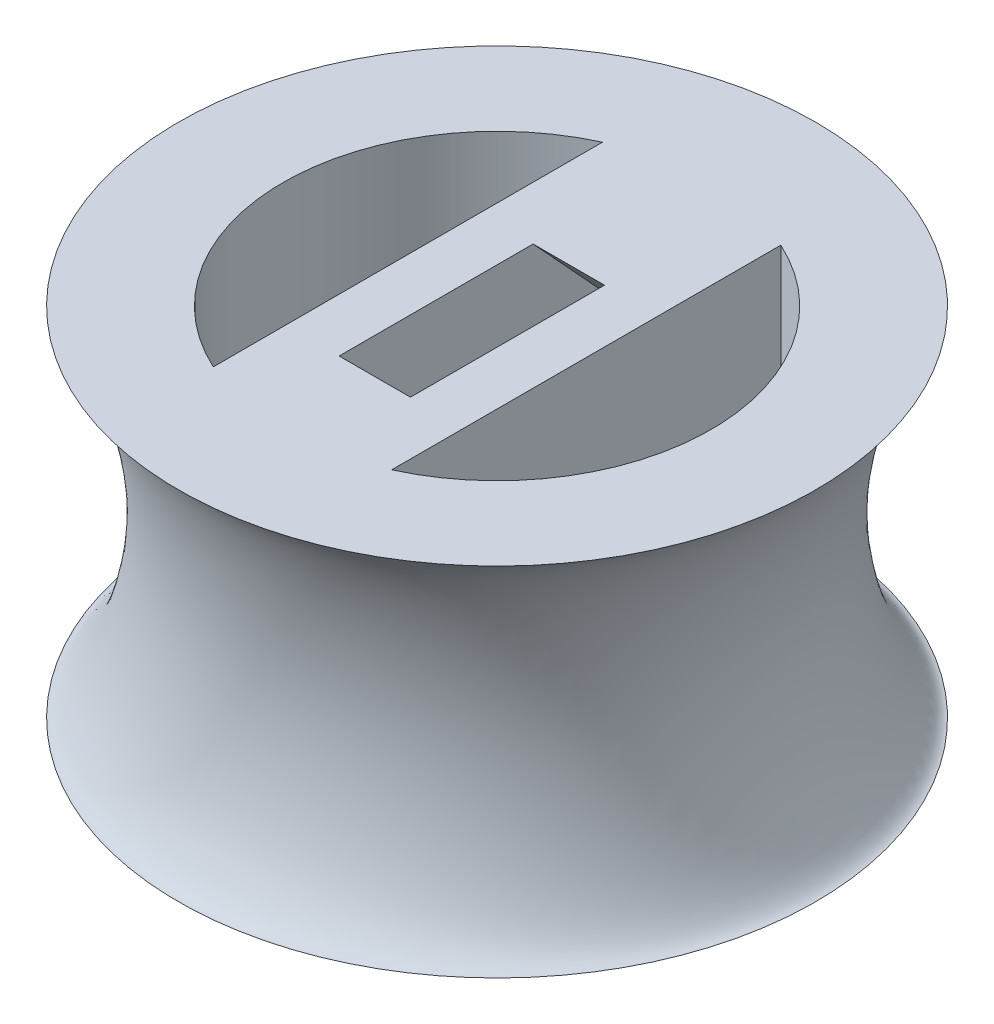
ISO-10303-21;
HEADER;
FILE_DESCRIPTION(('STEP AP214'),'2;1');
FILE_NAME('part.step','',(''),(''),'','','');
FILE_SCHEMA(('AUTOMOTIVE_DESIGN { 1 0 10303 214 1 1 1 1 }'));
ENDSEC;
DATA;
#1=APPLICATION_CONTEXT('core data for automotive mechanical design processes');
#2=APPLICATION_PROTOCOL_DEFINITION('international standard','automotive_design',2000,#1);
#3=PRODUCT_CONTEXT('',#1,'mechanical');
#4=PRODUCT('Part','Part','',(#3));
#5=PRODUCT_RELATED_PRODUCT_CATEGORY('part','',(#4));
#6=PRODUCT_DEFINITION_FORMATION('','',#4);
#7=PRODUCT_DEFINITION_CONTEXT('part definition',#1,'design');
#8=PRODUCT_DEFINITION('design','',#6,#7);
#9=PRODUCT_DEFINITION_SHAPE('','',#8);
#10=(LENGTH_UNIT() NAMED_UNIT(*) SI_UNIT(.MILLI.,.METRE.));
#11=(NAMED_UNIT(*) PLANE_ANGLE_UNIT() SI_UNIT($,.RADIAN.));
#12=(NAMED_UNIT(*) SI_UNIT($,.STERADIAN.) SOLID_ANGLE_UNIT());
#13=UNCERTAINTY_MEASURE_WITH_UNIT(LENGTH_MEASURE(1.E-05),#10,'distance_accuracy_value','');
#14=(GEOMETRIC_REPRESENTATION_CONTEXT(3) GLOBAL_UNCERTAINTY_ASSIGNED_CONTEXT((#13)) GLOBAL_UNIT_ASSIGNED_CONTEXT((#10,
#11,#12)) REPRESENTATION_CONTEXT('',''));
#15=CARTESIAN_POINT('',(0.,0.,0.));
#16=DIRECTION('',(0.,0.,1.));
#17=DIRECTION('',(1.,0.,0.));
#18=AXIS2_PLACEMENT_3D('',#15,#16,#17);
#19=CARTESIAN_POINT('',(0.,10.,0.));
#20=DIRECTION('',(0.,1.,0.));
#21=DIRECTION('',(0.,0.,1.));
#22=AXIS2_PLACEMENT_3D('',#19,#20,#21);
#23=PLANE('',#22);
#24=DIRECTION('',(0.,0.,-1.));
#25=VECTOR('',#24,1.);
#26=CARTESIAN_POINT('',(-2.5,10.,0.));
#27=LINE('',#26,#25);
#28=CARTESIAN_POINT('',(-2.5,10.,5.45435605731786));
#29=VERTEX_POINT('',#28);
#30=CARTESIAN_POINT('',(-2.5,10.,-5.45435605731786));
#31=VERTEX_POINT('',#30);
#32=EDGE_CURVE('E146',#29,#31,#27,.T.);
#33=ORIENTED_EDGE('',*,*,#32,.F.);
#34=CARTESIAN_POINT('',(0.,10.,0.));
#35=DIRECTION('',(0.,1.,0.));
#36=DIRECTION('',(0.,0.,1.));
#37=AXIS2_PLACEMENT_3D('',#34,#35,#36);
#38=CIRCLE('',#37,6.);
#39=EDGE_CURVE('E142',#31,#29,#38,.T.);
#40=ORIENTED_EDGE('',*,*,#39,.F.);
#41=EDGE_LOOP('',(#33,#40));
#42=FACE_BOUND('',#41,.T.);
#43=CARTESIAN_POINT('',(0.,10.,0.));
#44=DIRECTION('',(0.,-1.,0.));
#45=DIRECTION('',(0.,0.,-1.));
#46=AXIS2_PLACEMENT_3D('',#43,#44,#45);
#47=CIRCLE('',#46,8.92992468574349);
#48=CARTESIAN_POINT('',(0.,10.,-8.92992468574349));
#49=VERTEX_POINT('',#48);
#50=EDGE_CURVE('E11',#49,#49,#47,.T.);
#51=ORIENTED_EDGE('',*,*,#50,.F.);
#52=EDGE_LOOP('',(#51));
#53=FACE_BOUND('',#52,.T.);
#54=CARTESIAN_POINT('',(0.,10.,0.));
#55=DIRECTION('',(0.,1.,0.));
#56=DIRECTION('',(0.,0.,1.));
#57=AXIS2_PLACEMENT_3D('',#54,#55,#56);
#58=CIRCLE('',#57,6.);
#59=CARTESIAN_POINT('',(2.5,10.,5.45435605731786));
#60=VERTEX_POINT('',#59);
#61=CARTESIAN_POINT('',(2.5,10.,-5.45435605731786));
#62=VERTEX_POINT('',#61);
#63=EDGE_CURVE('E134',#60,#62,#58,.T.);
#64=ORIENTED_EDGE('',*,*,#63,.F.);
#65=DIRECTION('',(0.,0.,-1.));
#66=VECTOR('',#65,1.);
#67=CARTESIAN_POINT('',(2.5,10.,0.));
#68=LINE('',#67,#66);
#69=EDGE_CURVE('E131',#60,#62,#68,.T.);
#70=ORIENTED_EDGE('',*,*,#69,.T.);
#71=EDGE_LOOP('',(#64,#70));
#72=FACE_BOUND('',#71,.T.);
#73=DIRECTION('',(1.,0.,0.));
#74=VECTOR('',#73,1.);
#75=CARTESIAN_POINT('',(-1.,10.,3.42764163278939));
#76=LINE('',#75,#74);
#77=CARTESIAN_POINT('',(-1.,10.,3.42764163278939));
#78=VERTEX_POINT('',#77);
#79=CARTESIAN_POINT('',(1.,10.,3.42764163278939));
#80=VERTEX_POINT('',#79);
#81=EDGE_CURVE('E319',#78,#80,#76,.T.);
#82=ORIENTED_EDGE('',*,*,#81,.F.);
#83=DIRECTION('',(0.,0.,-1.));
#84=VECTOR('',#83,1.);
#85=CARTESIAN_POINT('',(-1.,10.,3.42764163278939));
#86=LINE('',#85,#84);
#87=CARTESIAN_POINT('',(-1.,10.,-2.01113744006485));
#88=VERTEX_POINT('',#87);
#89=EDGE_CURVE('E130',#78,#88,#86,.T.);
#90=ORIENTED_EDGE('',*,*,#89,.T.);
#91=DIRECTION('',(1.,0.,0.));
#92=VECTOR('',#91,1.);
#93=CARTESIAN_POINT('',(-1.,10.,-2.01113744006485));
#94=LINE('',#93,#92);
#95=CARTESIAN_POINT('',(1.,10.,-2.01113744006485));
#96=VERTEX_POINT('',#95);
#97=EDGE_CURVE('E115',#88,#96,#94,.T.);
#98=ORIENTED_EDGE('',*,*,#97,.T.);
#99=DIRECTION('',(0.,0.,-1.));
#100=VECTOR('',#99,1.);
#101=CARTESIAN_POINT('',(1.,10.,3.42764163278939));
#102=LINE('',#101,#100);
#103=EDGE_CURVE('E122',#80,#96,#102,.T.);
#104=ORIENTED_EDGE('',*,*,#103,.F.);
#105=EDGE_LOOP('',(#82,#90,#98,#104));
#106=FACE_BOUND('',#105,.T.);
#107=ADVANCED_FACE('F33',(#42,#53,#72,#106),#23,.T.);
#108=CARTESIAN_POINT('',(0.,0.,0.));
#109=DIRECTION('',(0.,1.,0.));
#110=DIRECTION('',(0.,0.,1.));
#111=AXIS2_PLACEMENT_3D('',#108,#109,#110);
#112=PLANE('',#111);
#113=CARTESIAN_POINT('',(0.,0.,0.));
#114=DIRECTION('',(0.,1.,0.));
#115=DIRECTION('',(0.,0.,1.));
#116=AXIS2_PLACEMENT_3D('',#113,#114,#115);
#117=CIRCLE('',#116,6.);
#118=CARTESIAN_POINT('',(-2.5,0.,-5.45435605731786));
#119=VERTEX_POINT('',#118);
#120=CARTESIAN_POINT('',(-2.5,0.,5.45435605731786));
#121=VERTEX_POINT('',#120);
#122=EDGE_CURVE('E141',#119,#121,#117,.T.);
#123=ORIENTED_EDGE('',*,*,#122,.T.);
#124=DIRECTION('',(0.,0.,-1.));
#125=VECTOR('',#124,1.);
#126=CARTESIAN_POINT('',(-2.5,0.,0.));
#127=LINE('',#126,#125);
#128=EDGE_CURVE('E56',#121,#119,#127,.T.);
#129=ORIENTED_EDGE('',*,*,#128,.T.);
#130=EDGE_LOOP('',(#123,#129));
#131=FACE_BOUND('',#130,.T.);
#132=CARTESIAN_POINT('',(0.,0.,0.));
#133=DIRECTION('',(0.,-1.,0.));
#134=DIRECTION('',(0.,0.,-1.));
#135=AXIS2_PLACEMENT_3D('',#132,#133,#134);
#136=CIRCLE('',#135,8.92992468574348);
#137=CARTESIAN_POINT('',(0.,0.,-8.92992468574348));
#138=VERTEX_POINT('',#137);
#139=EDGE_CURVE('E37',#138,#138,#136,.T.);
#140=ORIENTED_EDGE('',*,*,#139,.T.);
#141=EDGE_LOOP('',(#140));
#142=FACE_BOUND('',#141,.T.);
#143=DIRECTION('',(0.,0.,-1.));
#144=VECTOR('',#143,1.);
#145=CARTESIAN_POINT('',(2.5,0.,0.));
#146=LINE('',#145,#144);
#147=CARTESIAN_POINT('',(2.5,0.,5.45435605731786));
#148=VERTEX_POINT('',#147);
#149=CARTESIAN_POINT('',(2.5,0.,-5.45435605731786));
#150=VERTEX_POINT('',#149);
#151=EDGE_CURVE('E155',#148,#150,#146,.T.);
#152=ORIENTED_EDGE('',*,*,#151,.F.);
#153=CARTESIAN_POINT('',(0.,0.,0.));
#154=DIRECTION('',(0.,1.,0.));
#155=DIRECTION('',(0.,0.,1.));
#156=AXIS2_PLACEMENT_3D('',#153,#154,#155);
#157=CIRCLE('',#156,6.);
#158=EDGE_CURVE('E158',#148,#150,#157,.T.);
#159=ORIENTED_EDGE('',*,*,#158,.T.);
#160=EDGE_LOOP('',(#152,#159));
#161=FACE_BOUND('',#160,.T.);
#162=ADVANCED_FACE('F35',(#131,#142,#161),#112,.F.);
#163=CARTESIAN_POINT('',(-9.,10.,0.));
#164=CARTESIAN_POINT('',(-8.33917700840599,10.0905059359981,0.));
#165=CARTESIAN_POINT('',(-6.32082299159401,5.,0.));
#166=CARTESIAN_POINT('',(-10.2535725300821,-4.91881736489846,0.));
#167=CARTESIAN_POINT('',(-10.2535725300821,9.82831142890039,0.));
#168=CARTESIAN_POINT('',(-9.,10.,0.));
#169=B_SPLINE_CURVE_WITH_KNOTS('',3,(#163,#164,#165,#166,#167,#168),.UNSPECIFIED.,.T.,.F.,(4,1,
1,4),(0.,0.256608512321881,0.513217024643762,1.),.UNSPECIFIED.);
#170=CARTESIAN_POINT('',(0.,0.,0.));
#171=DIRECTION('',(0.,-1.,0.));
#172=AXIS1_PLACEMENT('',#170,#171);
#173=SURFACE_OF_REVOLUTION('',#169,#172);
#174=ORIENTED_EDGE('',*,*,#50,.T.);
#175=EDGE_LOOP('',(#174));
#176=FACE_BOUND('',#175,.T.);
#177=ORIENTED_EDGE('',*,*,#139,.F.);
#178=EDGE_LOOP('',(#177));
#179=FACE_BOUND('',#178,.T.);
#180=ADVANCED_FACE('F174',(#176,#179),#173,.T.);
#181=CARTESIAN_POINT('',(2.5,0.,0.));
#182=DIRECTION('',(1.,0.,0.));
#183=DIRECTION('',(0.,0.,-1.));
#184=AXIS2_PLACEMENT_3D('',#181,#182,#183);
#185=PLANE('',#184);
#186=ORIENTED_EDGE('',*,*,#69,.F.);
#187=DIRECTION('',(0.,1.,0.));
#188=VECTOR('',#187,1.);
#189=CARTESIAN_POINT('',(2.5,0.,5.45435605731786));
#190=LINE('',#189,#188);
#191=EDGE_CURVE('E160',#148,#60,#190,.T.);
#192=ORIENTED_EDGE('',*,*,#191,.F.);
#193=ORIENTED_EDGE('',*,*,#151,.T.);
#194=DIRECTION('',(0.,1.,0.));
#195=VECTOR('',#194,1.);
#196=CARTESIAN_POINT('',(2.5,0.,-5.45435605731786));
#197=LINE('',#196,#195);
#198=EDGE_CURVE('E148',#150,#62,#197,.T.);
#199=ORIENTED_EDGE('',*,*,#198,.T.);
#200=EDGE_LOOP('',(#186,#192,#193,#199));
#201=FACE_BOUND('',#200,.T.);
#202=ADVANCED_FACE('F177',(#201),#185,.T.);
#203=CARTESIAN_POINT('',(0.,0.,0.));
#204=DIRECTION('',(0.,1.,0.));
#205=DIRECTION('',(0.,0.,1.));
#206=AXIS2_PLACEMENT_3D('',#203,#204,#205);
#207=CYLINDRICAL_SURFACE('',#206,6.);
#208=ORIENTED_EDGE('',*,*,#63,.T.);
#209=ORIENTED_EDGE('',*,*,#198,.F.);
#210=ORIENTED_EDGE('',*,*,#158,.F.);
#211=ORIENTED_EDGE('',*,*,#191,.T.);
#212=EDGE_LOOP('',(#208,#209,#210,#211));
#213=FACE_BOUND('',#212,.T.);
#214=ADVANCED_FACE('F193',(#213),#207,.F.);
#215=CARTESIAN_POINT('',(-2.5,0.,0.));
#216=DIRECTION('',(1.,0.,0.));
#217=DIRECTION('',(0.,0.,-1.));
#218=AXIS2_PLACEMENT_3D('',#215,#216,#217);
#219=PLANE('',#218);
#220=ORIENTED_EDGE('',*,*,#32,.T.);
#221=DIRECTION('',(0.,1.,0.));
#222=VECTOR('',#221,1.);
#223=CARTESIAN_POINT('',(-2.5,0.,-5.45435605731786));
#224=LINE('',#223,#222);
#225=EDGE_CURVE('E145',#119,#31,#224,.T.);
#226=ORIENTED_EDGE('',*,*,#225,.F.);
#227=ORIENTED_EDGE('',*,*,#128,.F.);
#228=DIRECTION('',(0.,1.,0.));
#229=VECTOR('',#228,1.);
#230=CARTESIAN_POINT('',(-2.5,0.,5.45435605731786));
#231=LINE('',#230,#229);
#232=EDGE_CURVE('E151',#121,#29,#231,.T.);
#233=ORIENTED_EDGE('',*,*,#232,.T.);
#234=EDGE_LOOP('',(#220,#226,#227,#233));
#235=FACE_BOUND('',#234,.T.);
#236=ADVANCED_FACE('F202',(#235),#219,.F.);
#237=CARTESIAN_POINT('',(0.,0.,0.));
#238=DIRECTION('',(0.,1.,0.));
#239=DIRECTION('',(0.,0.,1.));
#240=AXIS2_PLACEMENT_3D('',#237,#238,#239);
#241=CYLINDRICAL_SURFACE('',#240,6.);
#242=ORIENTED_EDGE('',*,*,#39,.T.);
#243=ORIENTED_EDGE('',*,*,#232,.F.);
#244=ORIENTED_EDGE('',*,*,#122,.F.);
#245=ORIENTED_EDGE('',*,*,#225,.T.);
#246=EDGE_LOOP('',(#242,#243,#244,#245));
#247=FACE_BOUND('',#246,.T.);
#248=ADVANCED_FACE('F206',(#247),#241,.F.);
#249=CARTESIAN_POINT('',(-1.,10.,-2.01113744006485));
#250=DIRECTION('',(0.,-0.677569032479732,0.735459180529062));
#251=DIRECTION('',(0.,-0.735459180529062,-0.677569032479732));
#252=AXIS2_PLACEMENT_3D('',#249,#250,#251);
#253=PLANE('',#252);
#254=ORIENTED_EDGE('',*,*,#97,.F.);
#255=DIRECTION('',(0.,-0.735459180529062,-0.677569032479732));
#256=VECTOR('',#255,1.);
#257=CARTESIAN_POINT('',(-1.,10.,-2.01113744006485));
#258=LINE('',#257,#256);
#259=CARTESIAN_POINT('',(-1.,7.27660461908465,-4.52016638709513));
#260=VERTEX_POINT('',#259);
#261=EDGE_CURVE('E317',#88,#260,#258,.T.);
#262=ORIENTED_EDGE('',*,*,#261,.T.);
#263=DIRECTION('',(1.,0.,0.));
#264=VECTOR('',#263,1.);
#265=CARTESIAN_POINT('',(-1.,7.27660461908465,-4.52016638709513));
#266=LINE('',#265,#264);
#267=CARTESIAN_POINT('',(1.,7.27660461908465,-4.52016638709513));
#268=VERTEX_POINT('',#267);
#269=EDGE_CURVE('E118',#260,#268,#266,.T.);
#270=ORIENTED_EDGE('',*,*,#269,.T.);
#271=DIRECTION('',(0.,-0.735459180529062,-0.677569032479732));
#272=VECTOR('',#271,1.);
#273=CARTESIAN_POINT('',(1.,10.,-2.01113744006485));
#274=LINE('',#273,#272);
#275=EDGE_CURVE('E112',#96,#268,#274,.T.);
#276=ORIENTED_EDGE('',*,*,#275,.F.);
#277=EDGE_LOOP('',(#254,#262,#270,#276));
#278=FACE_BOUND('',#277,.T.);
#279=ADVANCED_FACE('F113',(#278),#253,.T.);
#280=CARTESIAN_POINT('',(-1.,6.59903558660492,-3.78470720656607));
#281=DIRECTION('',(1.,0.,0.));
#282=DIRECTION('',(0.,0.,-1.));
#283=AXIS2_PLACEMENT_3D('',#280,#281,#282);
#284=CYLINDRICAL_SURFACE('',#283,1.);
#285=ORIENTED_EDGE('',*,*,#269,.F.);
#286=CARTESIAN_POINT('',(-1.,6.59903558660492,-3.78470720656607));
#287=DIRECTION('',(-1.,0.,0.));
#288=DIRECTION('',(0.,0.,-1.));
#289=AXIS2_PLACEMENT_3D('',#286,#287,#288);
#290=CIRCLE('',#289,1.);
#291=CARTESIAN_POINT('',(-1.,5.86357640607585,-4.4622762390458));
#292=VERTEX_POINT('',#291);
#293=EDGE_CURVE('E330',#260,#292,#290,.T.);
#294=ORIENTED_EDGE('',*,*,#293,.T.);
#295=DIRECTION('',(1.,0.,0.));
#296=VECTOR('',#295,1.);
#297=CARTESIAN_POINT('',(-1.,5.86357640607585,-4.4622762390458));
#298=LINE('',#297,#296);
#299=CARTESIAN_POINT('',(1.,5.86357640607585,-4.4622762390458));
#300=VERTEX_POINT('',#299);
#301=EDGE_CURVE('E136',#292,#300,#298,.T.);
#302=ORIENTED_EDGE('',*,*,#301,.T.);
#303=CARTESIAN_POINT('',(1.,6.59903558660492,-3.78470720656607));
#304=DIRECTION('',(-1.,0.,0.));
#305=DIRECTION('',(0.,0.,-1.));
#306=AXIS2_PLACEMENT_3D('',#303,#304,#305);
#307=CIRCLE('',#306,1.);
#308=EDGE_CURVE('E121',#268,#300,#307,.T.);
#309=ORIENTED_EDGE('',*,*,#308,.F.);
#310=EDGE_LOOP('',(#285,#294,#302,#309));
#311=FACE_BOUND('',#310,.T.);
#312=ADVANCED_FACE('F214',(#311),#284,.F.);
#313=CARTESIAN_POINT('',(-1.,5.86357640607585,-4.4622762390458));
#314=DIRECTION('',(0.,0.735459180529063,0.677569032479732));
#315=DIRECTION('',(0.,-0.677569032479732,0.735459180529062));
#316=AXIS2_PLACEMENT_3D('',#313,#314,#315);
#317=PLANE('',#316);
#318=ORIENTED_EDGE('',*,*,#301,.F.);
#319=DIRECTION('',(0.,-0.677569032479732,0.735459180529063));
#320=VECTOR('',#319,1.);
#321=CARTESIAN_POINT('',(-1.,5.86357640607585,-4.4622762390458));
#322=LINE('',#321,#320);
#323=CARTESIAN_POINT('',(-1.,4.50843834111639,-2.99135787798768));
#324=VERTEX_POINT('',#323);
#325=EDGE_CURVE('E344',#292,#324,#322,.T.);
#326=ORIENTED_EDGE('',*,*,#325,.T.);
#327=DIRECTION('',(1.,0.,0.));
#328=VECTOR('',#327,1.);
#329=CARTESIAN_POINT('',(-1.,4.50843834111639,-2.99135787798768));
#330=LINE('',#329,#328);
#331=CARTESIAN_POINT('',(1.,4.50843834111639,-2.99135787798768));
#332=VERTEX_POINT('',#331);
#333=EDGE_CURVE('E322',#324,#332,#330,.T.);
#334=ORIENTED_EDGE('',*,*,#333,.T.);
#335=DIRECTION('',(0.,-0.677569032479732,0.735459180529063));
#336=VECTOR('',#335,1.);
#337=CARTESIAN_POINT('',(1.,5.86357640607585,-4.4622762390458));
#338=LINE('',#337,#336);
#339=EDGE_CURVE('E333',#300,#332,#338,.T.);
#340=ORIENTED_EDGE('',*,*,#339,.F.);
#341=EDGE_LOOP('',(#318,#326,#334,#340));
#342=FACE_BOUND('',#341,.T.);
#343=ADVANCED_FACE('F217',(#342),#317,.T.);
#344=CARTESIAN_POINT('',(-1.,5.24389752164545,-2.31378884550795));
#345=DIRECTION('',(1.,0.,0.));
#346=DIRECTION('',(0.,0.,-1.));
#347=AXIS2_PLACEMENT_3D('',#344,#345,#346);
#348=CYLINDRICAL_SURFACE('',#347,1.);
#349=ORIENTED_EDGE('',*,*,#333,.F.);
#350=CARTESIAN_POINT('',(-1.,5.24389752164545,-2.31378884550795));
#351=DIRECTION('',(-1.,0.,0.));
#352=DIRECTION('',(0.,0.,1.));
#353=AXIS2_PLACEMENT_3D('',#350,#351,#352);
#354=CIRCLE('',#353,1.);
#355=CARTESIAN_POINT('',(-1.,4.56632848916572,-1.57832966497888));
#356=VERTEX_POINT('',#355);
#357=EDGE_CURVE('E324',#324,#356,#354,.T.);
#358=ORIENTED_EDGE('',*,*,#357,.T.);
#359=DIRECTION('',(1.,0.,0.));
#360=VECTOR('',#359,1.);
#361=CARTESIAN_POINT('',(-1.,4.56632848916572,-1.57832966497888));
#362=LINE('',#361,#360);
#363=CARTESIAN_POINT('',(1.,4.56632848916572,-1.57832966497888));
#364=VERTEX_POINT('',#363);
#365=EDGE_CURVE('E320',#356,#364,#362,.T.);
#366=ORIENTED_EDGE('',*,*,#365,.T.);
#367=CARTESIAN_POINT('',(1.,5.24389752164545,-2.31378884550795));
#368=DIRECTION('',(-1.,0.,0.));
#369=DIRECTION('',(0.,0.,1.));
#370=AXIS2_PLACEMENT_3D('',#367,#368,#369);
#371=CIRCLE('',#370,1.);
#372=EDGE_CURVE('E336',#332,#364,#371,.T.);
#373=ORIENTED_EDGE('',*,*,#372,.F.);
#374=EDGE_LOOP('',(#349,#358,#366,#373));
#375=FACE_BOUND('',#374,.T.);
#376=ADVANCED_FACE('F221',(#375),#348,.F.);
#377=CARTESIAN_POINT('',(-1.,4.56632848916572,-1.57832966497888));
#378=DIRECTION('',(0.,0.677569032479732,-0.735459180529063));
#379=DIRECTION('',(0.,0.735459180529063,0.677569032479732));
#380=AXIS2_PLACEMENT_3D('',#377,#378,#379);
#381=PLANE('',#380);
#382=ORIENTED_EDGE('',*,*,#365,.F.);
#383=DIRECTION('',(0.,0.735459180529063,0.677569032479732));
#384=VECTOR('',#383,1.);
#385=CARTESIAN_POINT('',(-1.,4.56632848916572,-1.57832966497888));
#386=LINE('',#385,#384);
#387=EDGE_CURVE('E315',#356,#78,#386,.T.);
#388=ORIENTED_EDGE('',*,*,#387,.T.);
#389=ORIENTED_EDGE('',*,*,#81,.T.);
#390=DIRECTION('',(0.,0.735459180529063,0.677569032479732));
#391=VECTOR('',#390,1.);
#392=CARTESIAN_POINT('',(1.,4.56632848916572,-1.57832966497888));
#393=LINE('',#392,#391);
#394=EDGE_CURVE('E48',#364,#80,#393,.T.);
#395=ORIENTED_EDGE('',*,*,#394,.F.);
#396=EDGE_LOOP('',(#382,#388,#389,#395));
#397=FACE_BOUND('',#396,.T.);
#398=ADVANCED_FACE('F225',(#397),#381,.T.);
#399=CARTESIAN_POINT('',(-1.,6.59903558660492,-3.78470720656607));
#400=DIRECTION('',(1.,0.,0.));
#401=DIRECTION('',(0.,0.,-1.));
#402=AXIS2_PLACEMENT_3D('',#399,#400,#401);
#403=PLANE('',#402);
#404=ORIENTED_EDGE('',*,*,#89,.F.);
#405=ORIENTED_EDGE('',*,*,#387,.F.);
#406=ORIENTED_EDGE('',*,*,#357,.F.);
#407=ORIENTED_EDGE('',*,*,#325,.F.);
#408=ORIENTED_EDGE('',*,*,#293,.F.);
#409=ORIENTED_EDGE('',*,*,#261,.F.);
#410=EDGE_LOOP('',(#404,#405,#406,#407,#408,#409));
#411=FACE_BOUND('',#410,.T.);
#412=ADVANCED_FACE('F229',(#411),#403,.T.);
#413=CARTESIAN_POINT('',(1.,6.59903558660492,-3.78470720656607));
#414=DIRECTION('',(1.,0.,0.));
#415=DIRECTION('',(0.,0.,-1.));
#416=AXIS2_PLACEMENT_3D('',#413,#414,#415);
#417=PLANE('',#416);
#418=ORIENTED_EDGE('',*,*,#103,.T.);
#419=ORIENTED_EDGE('',*,*,#275,.T.);
#420=ORIENTED_EDGE('',*,*,#308,.T.);
#421=ORIENTED_EDGE('',*,*,#339,.T.);
#422=ORIENTED_EDGE('',*,*,#372,.T.);
#423=ORIENTED_EDGE('',*,*,#394,.T.);
#424=EDGE_LOOP('',(#418,#419,#420,#421,#422,#423));
#425=FACE_BOUND('',#424,.T.);
#426=ADVANCED_FACE('F125',(#425),#417,.F.);
#427=CLOSED_SHELL('',(#107,#162,#180,#202,#214,#236,#248,#279,#312,#343,#376,#398,#412,#426));
#428=MANIFOLD_SOLID_BREP('B2',#427);
#429=ADVANCED_BREP_SHAPE_REPRESENTATION('',(#18,#428),#14);
#430=SHAPE_DEFINITION_REPRESENTATION(#9,#429);
ENDSEC;
END-ISO-10303-21;
